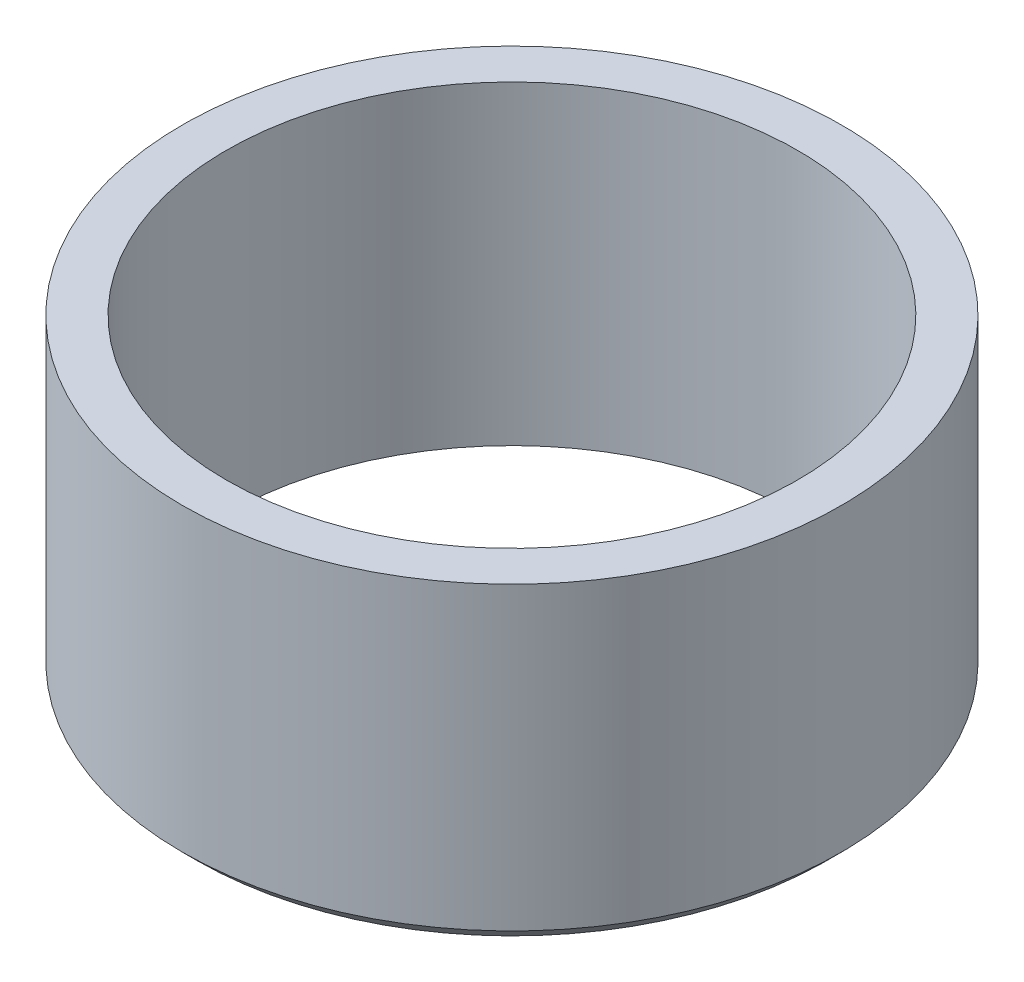
ISO-10303-21;
HEADER;
FILE_DESCRIPTION(('STEP AP214'),'2;1');
FILE_NAME('part.step','',(''),(''),'','','');
FILE_SCHEMA(('AUTOMOTIVE_DESIGN { 1 0 10303 214 1 1 1 1 }'));
ENDSEC;
DATA;
#1=APPLICATION_CONTEXT('core data for automotive mechanical design processes');
#2=APPLICATION_PROTOCOL_DEFINITION('international standard','automotive_design',2000,#1);
#3=PRODUCT_CONTEXT('',#1,'mechanical');
#4=PRODUCT('Part','Part','',(#3));
#5=PRODUCT_RELATED_PRODUCT_CATEGORY('part','',(#4));
#6=PRODUCT_DEFINITION_FORMATION('','',#4);
#7=PRODUCT_DEFINITION_CONTEXT('part definition',#1,'design');
#8=PRODUCT_DEFINITION('design','',#6,#7);
#9=PRODUCT_DEFINITION_SHAPE('','',#8);
#10=(LENGTH_UNIT() NAMED_UNIT(*) SI_UNIT(.MILLI.,.METRE.));
#11=(NAMED_UNIT(*) PLANE_ANGLE_UNIT() SI_UNIT($,.RADIAN.));
#12=(NAMED_UNIT(*) SI_UNIT($,.STERADIAN.) SOLID_ANGLE_UNIT());
#13=UNCERTAINTY_MEASURE_WITH_UNIT(LENGTH_MEASURE(1.E-05),#10,'distance_accuracy_value','');
#14=(GEOMETRIC_REPRESENTATION_CONTEXT(3) GLOBAL_UNCERTAINTY_ASSIGNED_CONTEXT((#13)) GLOBAL_UNIT_ASSIGNED_CONTEXT((#10,
#11,#12)) REPRESENTATION_CONTEXT('',''));
#15=CARTESIAN_POINT('',(0.,0.,0.));
#16=DIRECTION('',(0.,0.,1.));
#17=DIRECTION('',(1.,0.,0.));
#18=AXIS2_PLACEMENT_3D('',#15,#16,#17);
#19=CARTESIAN_POINT('',(0.,4.3,0.));
#20=DIRECTION('',(0.,-1.,0.));
#21=DIRECTION('',(0.,0.,-1.));
#22=AXIS2_PLACEMENT_3D('',#19,#20,#21);
#23=CYLINDRICAL_SURFACE('',#22,4.5);
#24=CARTESIAN_POINT('',(0.,0.200000000000006,0.));
#25=DIRECTION('',(0.,1.,0.));
#26=DIRECTION('',(0.,0.,1.));
#27=AXIS2_PLACEMENT_3D('',#24,#25,#26);
#28=CIRCLE('',#27,4.5);
#29=CARTESIAN_POINT('',(0.,0.200000000000006,4.5));
#30=VERTEX_POINT('',#29);
#31=EDGE_CURVE('E52',#30,#30,#28,.T.);
#32=ORIENTED_EDGE('',*,*,#31,.T.);
#33=EDGE_LOOP('',(#32));
#34=FACE_BOUND('',#33,.T.);
#35=CARTESIAN_POINT('',(0.,4.3,0.));
#36=DIRECTION('',(0.,1.,0.));
#37=DIRECTION('',(0.,0.,1.));
#38=AXIS2_PLACEMENT_3D('',#35,#36,#37);
#39=CIRCLE('',#38,4.5);
#40=CARTESIAN_POINT('',(0.,4.3,4.5));
#41=VERTEX_POINT('',#40);
#42=EDGE_CURVE('E56',#41,#41,#39,.T.);
#43=ORIENTED_EDGE('',*,*,#42,.F.);
#44=EDGE_LOOP('',(#43));
#45=FACE_BOUND('',#44,.T.);
#46=ADVANCED_FACE('F45',(#34,#45),#23,.T.);
#47=CARTESIAN_POINT('',(0.,4.3,0.));
#48=DIRECTION('',(0.,1.,0.));
#49=DIRECTION('',(0.,0.,1.));
#50=AXIS2_PLACEMENT_3D('',#47,#48,#49);
#51=PLANE('',#50);
#52=CARTESIAN_POINT('',(0.,4.3,0.));
#53=DIRECTION('',(0.,1.,0.));
#54=DIRECTION('',(0.,0.,1.));
#55=AXIS2_PLACEMENT_3D('',#52,#53,#54);
#56=CIRCLE('',#55,3.9);
#57=CARTESIAN_POINT('',(0.,4.3,3.9));
#58=VERTEX_POINT('',#57);
#59=EDGE_CURVE('E63',#58,#58,#56,.T.);
#60=ORIENTED_EDGE('',*,*,#59,.F.);
#61=EDGE_LOOP('',(#60));
#62=FACE_BOUND('',#61,.T.);
#63=ORIENTED_EDGE('',*,*,#42,.T.);
#64=EDGE_LOOP('',(#63));
#65=FACE_BOUND('',#64,.T.);
#66=ADVANCED_FACE('F77',(#62,#65),#51,.T.);
#67=CARTESIAN_POINT('',(0.,0.,0.));
#68=DIRECTION('',(0.,1.,0.));
#69=DIRECTION('',(0.,0.,1.));
#70=AXIS2_PLACEMENT_3D('',#67,#68,#69);
#71=PLANE('',#70);
#72=CARTESIAN_POINT('',(0.,0.,0.));
#73=DIRECTION('',(0.,1.,0.));
#74=DIRECTION('',(0.,0.,1.));
#75=AXIS2_PLACEMENT_3D('',#72,#73,#74);
#76=CIRCLE('',#75,4.29999999999999);
#77=CARTESIAN_POINT('',(0.,0.,4.29999999999999));
#78=VERTEX_POINT('',#77);
#79=EDGE_CURVE('E12',#78,#78,#76,.F.);
#80=ORIENTED_EDGE('',*,*,#79,.T.);
#81=EDGE_LOOP('',(#80));
#82=FACE_BOUND('',#81,.T.);
#83=CARTESIAN_POINT('',(0.,0.,0.));
#84=DIRECTION('',(0.,1.,0.));
#85=DIRECTION('',(0.,0.,1.));
#86=AXIS2_PLACEMENT_3D('',#83,#84,#85);
#87=CIRCLE('',#86,3.9);
#88=CARTESIAN_POINT('',(0.,0.,3.9));
#89=VERTEX_POINT('',#88);
#90=EDGE_CURVE('E60',#89,#89,#87,.T.);
#91=ORIENTED_EDGE('',*,*,#90,.T.);
#92=EDGE_LOOP('',(#91));
#93=FACE_BOUND('',#92,.T.);
#94=ADVANCED_FACE('F69',(#82,#93),#71,.F.);
#95=CARTESIAN_POINT('',(0.,0.,0.));
#96=DIRECTION('',(0.,1.,0.));
#97=DIRECTION('',(0.,0.,1.));
#98=AXIS2_PLACEMENT_3D('',#95,#96,#97);
#99=CYLINDRICAL_SURFACE('',#98,3.9);
#100=ORIENTED_EDGE('',*,*,#90,.F.);
#101=EDGE_LOOP('',(#100));
#102=FACE_BOUND('',#101,.T.);
#103=ORIENTED_EDGE('',*,*,#59,.T.);
#104=EDGE_LOOP('',(#103));
#105=FACE_BOUND('',#104,.T.);
#106=ADVANCED_FACE('F71',(#102,#105),#99,.F.);
#107=CARTESIAN_POINT('',(0.,0.200000000000005,0.));
#108=DIRECTION('',(0.,1.,0.));
#109=DIRECTION('',(0.,0.,1.));
#110=AXIS2_PLACEMENT_3D('',#107,#108,#109);
#111=CONICAL_SURFACE('',#110,4.5,0.78539816339745);
#112=ORIENTED_EDGE('',*,*,#79,.F.);
#113=EDGE_LOOP('',(#112));
#114=FACE_BOUND('',#113,.T.);
#115=ORIENTED_EDGE('',*,*,#31,.F.);
#116=EDGE_LOOP('',(#115));
#117=FACE_BOUND('',#116,.T.);
#118=ADVANCED_FACE('F47',(#114,#117),#111,.T.);
#119=CLOSED_SHELL('',(#46,#66,#94,#106,#118));
#120=MANIFOLD_SOLID_BREP('B2',#119);
#121=ADVANCED_BREP_SHAPE_REPRESENTATION('',(#18,#120),#14);
#122=SHAPE_DEFINITION_REPRESENTATION(#9,#121);
ENDSEC;
END-ISO-10303-21;
